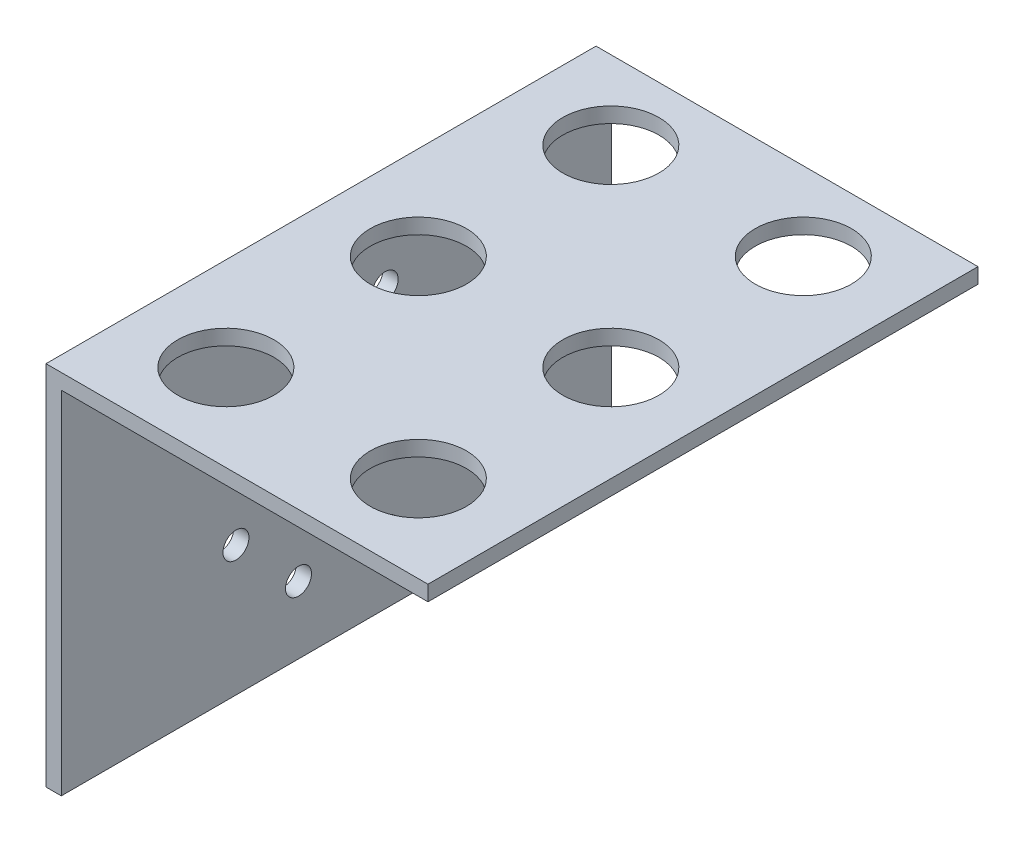
ISO-10303-21;
HEADER;
FILE_DESCRIPTION(('STEP AP214'),'2;1');
FILE_NAME('part.step','',(''),(''),'','','');
FILE_SCHEMA(('AUTOMOTIVE_DESIGN { 1 0 10303 214 1 1 1 1 }'));
ENDSEC;
DATA;
#1=APPLICATION_CONTEXT('core data for automotive mechanical design processes');
#2=APPLICATION_PROTOCOL_DEFINITION('international standard','automotive_design',2000,#1);
#3=PRODUCT_CONTEXT('',#1,'mechanical');
#4=PRODUCT('Part','Part','',(#3));
#5=PRODUCT_RELATED_PRODUCT_CATEGORY('part','',(#4));
#6=PRODUCT_DEFINITION_FORMATION('','',#4);
#7=PRODUCT_DEFINITION_CONTEXT('part definition',#1,'design');
#8=PRODUCT_DEFINITION('design','',#6,#7);
#9=PRODUCT_DEFINITION_SHAPE('','',#8);
#10=(LENGTH_UNIT() NAMED_UNIT(*) SI_UNIT(.MILLI.,.METRE.));
#11=(NAMED_UNIT(*) PLANE_ANGLE_UNIT() SI_UNIT($,.RADIAN.));
#12=(NAMED_UNIT(*) SI_UNIT($,.STERADIAN.) SOLID_ANGLE_UNIT());
#13=UNCERTAINTY_MEASURE_WITH_UNIT(LENGTH_MEASURE(1.E-05),#10,'distance_accuracy_value','');
#14=(GEOMETRIC_REPRESENTATION_CONTEXT(3) GLOBAL_UNCERTAINTY_ASSIGNED_CONTEXT((#13)) GLOBAL_UNIT_ASSIGNED_CONTEXT((#10,
#11,#12)) REPRESENTATION_CONTEXT('',''));
#15=CARTESIAN_POINT('',(0.,0.,0.));
#16=DIRECTION('',(0.,0.,1.));
#17=DIRECTION('',(1.,0.,0.));
#18=AXIS2_PLACEMENT_3D('',#15,#16,#17);
#19=CARTESIAN_POINT('',(-25.6516535121618,-10.7187266461533,57.15));
#20=DIRECTION('',(1.,0.,0.));
#21=DIRECTION('',(0.,0.,-1.));
#22=AXIS2_PLACEMENT_3D('',#19,#20,#21);
#23=PLANE('',#22);
#24=CARTESIAN_POINT('',(-25.6516535121618,-3.71872664615332,32.5));
#25=DIRECTION('',(1.,0.,0.));
#26=DIRECTION('',(0.,0.,-1.));
#27=AXIS2_PLACEMENT_3D('',#24,#25,#26);
#28=CIRCLE('',#27,1.35);
#29=CARTESIAN_POINT('',(-25.6516535121618,-3.71872664615332,31.15));
#30=VERTEX_POINT('',#29);
#31=EDGE_CURVE('E185',#30,#30,#28,.T.);
#32=ORIENTED_EDGE('',*,*,#31,.T.);
#33=EDGE_LOOP('',(#32));
#34=FACE_BOUND('',#33,.T.);
#35=CARTESIAN_POINT('',(-25.6516535121618,-3.71872664615332,23.5));
#36=DIRECTION('',(1.,0.,0.));
#37=DIRECTION('',(0.,0.,-1.));
#38=AXIS2_PLACEMENT_3D('',#35,#36,#37);
#39=CIRCLE('',#38,1.35);
#40=CARTESIAN_POINT('',(-25.6516535121618,-3.71872664615332,22.15));
#41=VERTEX_POINT('',#40);
#42=EDGE_CURVE('E179',#41,#41,#39,.T.);
#43=ORIENTED_EDGE('',*,*,#42,.T.);
#44=EDGE_LOOP('',(#43));
#45=FACE_BOUND('',#44,.T.);
#46=CARTESIAN_POINT('',(-25.6516535121618,2.78127335384669,16.9999999999998));
#47=DIRECTION('',(1.,0.,0.));
#48=DIRECTION('',(0.,0.,-1.));
#49=AXIS2_PLACEMENT_3D('',#46,#47,#48);
#50=CIRCLE('',#49,1.35);
#51=CARTESIAN_POINT('',(-25.6516535121618,2.78127335384669,15.6499999999998));
#52=VERTEX_POINT('',#51);
#53=EDGE_CURVE('E173',#52,#52,#50,.T.);
#54=ORIENTED_EDGE('',*,*,#53,.T.);
#55=EDGE_LOOP('',(#54));
#56=FACE_BOUND('',#55,.T.);
#57=CARTESIAN_POINT('',(-25.6516535121618,11.7812733538467,16.9999999999998));
#58=DIRECTION('',(1.,0.,0.));
#59=DIRECTION('',(0.,0.,-1.));
#60=AXIS2_PLACEMENT_3D('',#57,#58,#59);
#61=CIRCLE('',#60,1.35);
#62=CARTESIAN_POINT('',(-25.6516535121618,11.7812733538467,15.6499999999998));
#63=VERTEX_POINT('',#62);
#64=EDGE_CURVE('E167',#63,#63,#61,.T.);
#65=ORIENTED_EDGE('',*,*,#64,.T.);
#66=EDGE_LOOP('',(#65));
#67=FACE_BOUND('',#66,.T.);
#68=CARTESIAN_POINT('',(-25.6516535121618,18.2812733538467,23.5));
#69=DIRECTION('',(1.,0.,0.));
#70=DIRECTION('',(0.,0.,-1.));
#71=AXIS2_PLACEMENT_3D('',#68,#69,#70);
#72=CIRCLE('',#71,1.35);
#73=CARTESIAN_POINT('',(-25.6516535121618,18.2812733538467,22.15));
#74=VERTEX_POINT('',#73);
#75=EDGE_CURVE('E161',#74,#74,#72,.T.);
#76=ORIENTED_EDGE('',*,*,#75,.T.);
#77=EDGE_LOOP('',(#76));
#78=FACE_BOUND('',#77,.T.);
#79=CARTESIAN_POINT('',(-25.6516535121618,18.2812733538467,32.5));
#80=DIRECTION('',(1.,0.,0.));
#81=DIRECTION('',(0.,0.,-1.));
#82=AXIS2_PLACEMENT_3D('',#79,#80,#81);
#83=CIRCLE('',#82,1.35);
#84=CARTESIAN_POINT('',(-25.6516535121618,18.2812733538467,31.15));
#85=VERTEX_POINT('',#84);
#86=EDGE_CURVE('E155',#85,#85,#83,.T.);
#87=ORIENTED_EDGE('',*,*,#86,.T.);
#88=EDGE_LOOP('',(#87));
#89=FACE_BOUND('',#88,.T.);
#90=CARTESIAN_POINT('',(-25.6516535121618,11.7812733538467,38.9999999999998));
#91=DIRECTION('',(1.,0.,0.));
#92=DIRECTION('',(0.,0.,-1.));
#93=AXIS2_PLACEMENT_3D('',#90,#91,#92);
#94=CIRCLE('',#93,1.35);
#95=CARTESIAN_POINT('',(-25.6516535121618,11.7812733538467,37.6499999999998));
#96=VERTEX_POINT('',#95);
#97=EDGE_CURVE('E149',#96,#96,#94,.T.);
#98=ORIENTED_EDGE('',*,*,#97,.T.);
#99=EDGE_LOOP('',(#98));
#100=FACE_BOUND('',#99,.T.);
#101=CARTESIAN_POINT('',(-25.6516535121618,2.78127335384667,38.9999999999998));
#102=DIRECTION('',(1.,0.,0.));
#103=DIRECTION('',(0.,0.,-1.));
#104=AXIS2_PLACEMENT_3D('',#101,#102,#103);
#105=CIRCLE('',#104,1.35);
#106=CARTESIAN_POINT('',(-25.6516535121618,2.78127335384667,37.6499999999998));
#107=VERTEX_POINT('',#106);
#108=EDGE_CURVE('E120',#107,#107,#105,.T.);
#109=ORIENTED_EDGE('',*,*,#108,.T.);
#110=EDGE_LOOP('',(#109));
#111=FACE_BOUND('',#110,.T.);
#112=DIRECTION('',(0.,-1.,0.));
#113=VECTOR('',#112,1.);
#114=CARTESIAN_POINT('',(-25.6516535121618,-10.7187266461533,0.));
#115=LINE('',#114,#113);
#116=CARTESIAN_POINT('',(-25.6516535121618,27.3812733538467,0.));
#117=VERTEX_POINT('',#116);
#118=CARTESIAN_POINT('',(-25.6516535121618,-10.7187266461533,0.));
#119=VERTEX_POINT('',#118);
#120=EDGE_CURVE('E116',#117,#119,#115,.T.);
#121=ORIENTED_EDGE('',*,*,#120,.T.);
#122=DIRECTION('',(0.,0.,-1.));
#123=VECTOR('',#122,1.);
#124=CARTESIAN_POINT('',(-25.6516535121618,-10.7187266461533,57.15));
#125=LINE('',#124,#123);
#126=CARTESIAN_POINT('',(-25.6516535121618,-10.7187266461533,57.15));
#127=VERTEX_POINT('',#126);
#128=EDGE_CURVE('E11',#127,#119,#125,.T.);
#129=ORIENTED_EDGE('',*,*,#128,.F.);
#130=DIRECTION('',(0.,-1.,0.));
#131=VECTOR('',#130,1.);
#132=CARTESIAN_POINT('',(-25.6516535121618,-10.7187266461533,57.15));
#133=LINE('',#132,#131);
#134=CARTESIAN_POINT('',(-25.6516535121618,27.3812733538467,57.15));
#135=VERTEX_POINT('',#134);
#136=EDGE_CURVE('E128',#135,#127,#133,.T.);
#137=ORIENTED_EDGE('',*,*,#136,.F.);
#138=DIRECTION('',(0.,0.,-1.));
#139=VECTOR('',#138,1.);
#140=CARTESIAN_POINT('',(-25.6516535121618,27.3812733538467,57.15));
#141=LINE('',#140,#139);
#142=EDGE_CURVE('E112',#135,#117,#141,.T.);
#143=ORIENTED_EDGE('',*,*,#142,.T.);
#144=EDGE_LOOP('',(#121,#129,#137,#143));
#145=FACE_BOUND('',#144,.T.);
#146=ADVANCED_FACE('F31',(#34,#45,#56,#67,#78,#89,#100,#111,#145),#23,.F.);
#147=CARTESIAN_POINT('',(-25.6516535121618,-10.7187266461533,57.15));
#148=DIRECTION('',(0.,1.,0.));
#149=DIRECTION('',(0.,0.,1.));
#150=AXIS2_PLACEMENT_3D('',#147,#148,#149);
#151=PLANE('',#150);
#152=DIRECTION('',(1.,0.,0.));
#153=VECTOR('',#152,1.);
#154=CARTESIAN_POINT('',(-25.6516535121618,-10.7187266461533,0.));
#155=LINE('',#154,#153);
#156=CARTESIAN_POINT('',(-24.0641535121618,-10.7187266461533,0.));
#157=VERTEX_POINT('',#156);
#158=EDGE_CURVE('E119',#119,#157,#155,.T.);
#159=ORIENTED_EDGE('',*,*,#158,.T.);
#160=DIRECTION('',(0.,0.,-1.));
#161=VECTOR('',#160,1.);
#162=CARTESIAN_POINT('',(-24.0641535121618,-10.7187266461533,57.15));
#163=LINE('',#162,#161);
#164=CARTESIAN_POINT('',(-24.0641535121618,-10.7187266461533,57.15));
#165=VERTEX_POINT('',#164);
#166=EDGE_CURVE('E39',#165,#157,#163,.T.);
#167=ORIENTED_EDGE('',*,*,#166,.F.);
#168=DIRECTION('',(1.,0.,0.));
#169=VECTOR('',#168,1.);
#170=CARTESIAN_POINT('',(-25.6516535121618,-10.7187266461533,57.15));
#171=LINE('',#170,#169);
#172=EDGE_CURVE('E82',#127,#165,#171,.T.);
#173=ORIENTED_EDGE('',*,*,#172,.F.);
#174=ORIENTED_EDGE('',*,*,#128,.T.);
#175=EDGE_LOOP('',(#159,#167,#173,#174));
#176=FACE_BOUND('',#175,.T.);
#177=ADVANCED_FACE('F267',(#176),#151,.F.);
#178=CARTESIAN_POINT('',(-24.0641535121618,-10.7187266461533,57.15));
#179=DIRECTION('',(-1.,0.,0.));
#180=DIRECTION('',(0.,0.,1.));
#181=AXIS2_PLACEMENT_3D('',#178,#179,#180);
#182=PLANE('',#181);
#183=CARTESIAN_POINT('',(-24.0641535121618,-3.71872664615332,32.5));
#184=DIRECTION('',(1.,0.,0.));
#185=DIRECTION('',(0.,0.,-1.));
#186=AXIS2_PLACEMENT_3D('',#183,#184,#185);
#187=CIRCLE('',#186,1.35);
#188=CARTESIAN_POINT('',(-24.0641535121618,-3.71872664615332,31.15));
#189=VERTEX_POINT('',#188);
#190=EDGE_CURVE('E182',#189,#189,#187,.T.);
#191=ORIENTED_EDGE('',*,*,#190,.F.);
#192=EDGE_LOOP('',(#191));
#193=FACE_BOUND('',#192,.T.);
#194=CARTESIAN_POINT('',(-24.0641535121618,-3.71872664615332,23.5));
#195=DIRECTION('',(1.,0.,0.));
#196=DIRECTION('',(0.,0.,-1.));
#197=AXIS2_PLACEMENT_3D('',#194,#195,#196);
#198=CIRCLE('',#197,1.35);
#199=CARTESIAN_POINT('',(-24.0641535121618,-3.71872664615332,22.15));
#200=VERTEX_POINT('',#199);
#201=EDGE_CURVE('E176',#200,#200,#198,.T.);
#202=ORIENTED_EDGE('',*,*,#201,.F.);
#203=EDGE_LOOP('',(#202));
#204=FACE_BOUND('',#203,.T.);
#205=CARTESIAN_POINT('',(-24.0641535121618,2.78127335384669,16.9999999999998));
#206=DIRECTION('',(1.,0.,0.));
#207=DIRECTION('',(0.,0.,-1.));
#208=AXIS2_PLACEMENT_3D('',#205,#206,#207);
#209=CIRCLE('',#208,1.35);
#210=CARTESIAN_POINT('',(-24.0641535121618,2.78127335384669,15.6499999999998));
#211=VERTEX_POINT('',#210);
#212=EDGE_CURVE('E170',#211,#211,#209,.T.);
#213=ORIENTED_EDGE('',*,*,#212,.F.);
#214=EDGE_LOOP('',(#213));
#215=FACE_BOUND('',#214,.T.);
#216=CARTESIAN_POINT('',(-24.0641535121618,11.7812733538467,16.9999999999998));
#217=DIRECTION('',(1.,0.,0.));
#218=DIRECTION('',(0.,0.,-1.));
#219=AXIS2_PLACEMENT_3D('',#216,#217,#218);
#220=CIRCLE('',#219,1.35);
#221=CARTESIAN_POINT('',(-24.0641535121618,11.7812733538467,15.6499999999998));
#222=VERTEX_POINT('',#221);
#223=EDGE_CURVE('E164',#222,#222,#220,.T.);
#224=ORIENTED_EDGE('',*,*,#223,.F.);
#225=EDGE_LOOP('',(#224));
#226=FACE_BOUND('',#225,.T.);
#227=CARTESIAN_POINT('',(-24.0641535121618,18.2812733538467,23.5));
#228=DIRECTION('',(1.,0.,0.));
#229=DIRECTION('',(0.,0.,-1.));
#230=AXIS2_PLACEMENT_3D('',#227,#228,#229);
#231=CIRCLE('',#230,1.35);
#232=CARTESIAN_POINT('',(-24.0641535121618,18.2812733538467,22.15));
#233=VERTEX_POINT('',#232);
#234=EDGE_CURVE('E158',#233,#233,#231,.T.);
#235=ORIENTED_EDGE('',*,*,#234,.F.);
#236=EDGE_LOOP('',(#235));
#237=FACE_BOUND('',#236,.T.);
#238=CARTESIAN_POINT('',(-24.0641535121618,18.2812733538467,32.5));
#239=DIRECTION('',(1.,0.,0.));
#240=DIRECTION('',(0.,0.,-1.));
#241=AXIS2_PLACEMENT_3D('',#238,#239,#240);
#242=CIRCLE('',#241,1.35);
#243=CARTESIAN_POINT('',(-24.0641535121618,18.2812733538467,31.15));
#244=VERTEX_POINT('',#243);
#245=EDGE_CURVE('E152',#244,#244,#242,.T.);
#246=ORIENTED_EDGE('',*,*,#245,.F.);
#247=EDGE_LOOP('',(#246));
#248=FACE_BOUND('',#247,.T.);
#249=CARTESIAN_POINT('',(-24.0641535121618,11.7812733538467,38.9999999999998));
#250=DIRECTION('',(1.,0.,0.));
#251=DIRECTION('',(0.,0.,-1.));
#252=AXIS2_PLACEMENT_3D('',#249,#250,#251);
#253=CIRCLE('',#252,1.35);
#254=CARTESIAN_POINT('',(-24.0641535121618,11.7812733538467,37.6499999999998));
#255=VERTEX_POINT('',#254);
#256=EDGE_CURVE('E146',#255,#255,#253,.T.);
#257=ORIENTED_EDGE('',*,*,#256,.F.);
#258=EDGE_LOOP('',(#257));
#259=FACE_BOUND('',#258,.T.);
#260=CARTESIAN_POINT('',(-24.0641535121618,2.78127335384667,38.9999999999998));
#261=DIRECTION('',(1.,0.,0.));
#262=DIRECTION('',(0.,0.,-1.));
#263=AXIS2_PLACEMENT_3D('',#260,#261,#262);
#264=CIRCLE('',#263,1.35);
#265=CARTESIAN_POINT('',(-24.0641535121618,2.78127335384667,37.6499999999998));
#266=VERTEX_POINT('',#265);
#267=EDGE_CURVE('E143',#266,#266,#264,.T.);
#268=ORIENTED_EDGE('',*,*,#267,.F.);
#269=EDGE_LOOP('',(#268));
#270=FACE_BOUND('',#269,.T.);
#271=DIRECTION('',(0.,1.,0.));
#272=VECTOR('',#271,1.);
#273=CARTESIAN_POINT('',(-24.0641535121618,-10.7187266461533,0.));
#274=LINE('',#273,#272);
#275=CARTESIAN_POINT('',(-24.0641535121618,25.7937733538467,0.));
#276=VERTEX_POINT('',#275);
#277=EDGE_CURVE('E122',#157,#276,#274,.T.);
#278=ORIENTED_EDGE('',*,*,#277,.T.);
#279=DIRECTION('',(0.,0.,-1.));
#280=VECTOR('',#279,1.);
#281=CARTESIAN_POINT('',(-24.0641535121618,25.7937733538467,57.15));
#282=LINE('',#281,#280);
#283=CARTESIAN_POINT('',(-24.0641535121618,25.7937733538467,57.15));
#284=VERTEX_POINT('',#283);
#285=EDGE_CURVE('E107',#284,#276,#282,.T.);
#286=ORIENTED_EDGE('',*,*,#285,.F.);
#287=DIRECTION('',(0.,1.,0.));
#288=VECTOR('',#287,1.);
#289=CARTESIAN_POINT('',(-24.0641535121618,-10.7187266461533,57.15));
#290=LINE('',#289,#288);
#291=EDGE_CURVE('E96',#165,#284,#290,.T.);
#292=ORIENTED_EDGE('',*,*,#291,.F.);
#293=ORIENTED_EDGE('',*,*,#166,.T.);
#294=EDGE_LOOP('',(#278,#286,#292,#293));
#295=FACE_BOUND('',#294,.T.);
#296=ADVANCED_FACE('F134',(#193,#204,#215,#226,#237,#248,#259,#270,#295),#182,.F.);
#297=CARTESIAN_POINT('',(-24.0641535121618,25.7937733538467,57.15));
#298=DIRECTION('',(0.,1.,0.));
#299=DIRECTION('',(0.,0.,1.));
#300=AXIS2_PLACEMENT_3D('',#297,#298,#299);
#301=PLANE('',#300);
#302=CARTESIAN_POINT('',(-15.9641535121618,25.7937733538467,8.15));
#303=DIRECTION('',(0.,-1.,0.));
#304=DIRECTION('',(0.,0.,-1.));
#305=AXIS2_PLACEMENT_3D('',#302,#303,#304);
#306=CIRCLE('',#305,5.);
#307=CARTESIAN_POINT('',(-15.9641535121618,25.7937733538467,3.15));
#308=VERTEX_POINT('',#307);
#309=EDGE_CURVE('E221',#308,#308,#306,.T.);
#310=ORIENTED_EDGE('',*,*,#309,.F.);
#311=EDGE_LOOP('',(#310));
#312=FACE_BOUND('',#311,.T.);
#313=CARTESIAN_POINT('',(-15.9641535121618,25.7937733538467,28.15));
#314=DIRECTION('',(0.,-1.,0.));
#315=DIRECTION('',(0.,0.,-1.));
#316=AXIS2_PLACEMENT_3D('',#313,#314,#315);
#317=CIRCLE('',#316,5.);
#318=CARTESIAN_POINT('',(-15.9641535121618,25.7937733538467,23.15));
#319=VERTEX_POINT('',#318);
#320=EDGE_CURVE('E215',#319,#319,#317,.T.);
#321=ORIENTED_EDGE('',*,*,#320,.F.);
#322=EDGE_LOOP('',(#321));
#323=FACE_BOUND('',#322,.T.);
#324=CARTESIAN_POINT('',(-15.9641535121618,25.7937733538467,48.15));
#325=DIRECTION('',(0.,-1.,0.));
#326=DIRECTION('',(0.,0.,-1.));
#327=AXIS2_PLACEMENT_3D('',#324,#325,#326);
#328=CIRCLE('',#327,5.);
#329=CARTESIAN_POINT('',(-15.9641535121618,25.7937733538467,43.15));
#330=VERTEX_POINT('',#329);
#331=EDGE_CURVE('E209',#330,#330,#328,.T.);
#332=ORIENTED_EDGE('',*,*,#331,.F.);
#333=EDGE_LOOP('',(#332));
#334=FACE_BOUND('',#333,.T.);
#335=CARTESIAN_POINT('',(4.03584648783822,25.7937733538467,8.15));
#336=DIRECTION('',(0.,-1.,0.));
#337=DIRECTION('',(0.,0.,-1.));
#338=AXIS2_PLACEMENT_3D('',#335,#336,#337);
#339=CIRCLE('',#338,5.);
#340=CARTESIAN_POINT('',(4.03584648783822,25.7937733538467,3.15));
#341=VERTEX_POINT('',#340);
#342=EDGE_CURVE('E203',#341,#341,#339,.T.);
#343=ORIENTED_EDGE('',*,*,#342,.F.);
#344=EDGE_LOOP('',(#343));
#345=FACE_BOUND('',#344,.T.);
#346=CARTESIAN_POINT('',(4.03584648783822,25.7937733538467,28.15));
#347=DIRECTION('',(0.,-1.,0.));
#348=DIRECTION('',(0.,0.,-1.));
#349=AXIS2_PLACEMENT_3D('',#346,#347,#348);
#350=CIRCLE('',#349,5.);
#351=CARTESIAN_POINT('',(4.03584648783822,25.7937733538467,23.15));
#352=VERTEX_POINT('',#351);
#353=EDGE_CURVE('E197',#352,#352,#350,.T.);
#354=ORIENTED_EDGE('',*,*,#353,.F.);
#355=EDGE_LOOP('',(#354));
#356=FACE_BOUND('',#355,.T.);
#357=CARTESIAN_POINT('',(4.03584648783822,25.7937733538467,48.15));
#358=DIRECTION('',(0.,-1.,0.));
#359=DIRECTION('',(0.,0.,-1.));
#360=AXIS2_PLACEMENT_3D('',#357,#358,#359);
#361=CIRCLE('',#360,5.);
#362=CARTESIAN_POINT('',(4.03584648783822,25.7937733538467,43.15));
#363=VERTEX_POINT('',#362);
#364=EDGE_CURVE('E191',#363,#363,#361,.T.);
#365=ORIENTED_EDGE('',*,*,#364,.F.);
#366=EDGE_LOOP('',(#365));
#367=FACE_BOUND('',#366,.T.);
#368=DIRECTION('',(1.,0.,0.));
#369=VECTOR('',#368,1.);
#370=CARTESIAN_POINT('',(-24.0641535121618,25.7937733538467,0.));
#371=LINE('',#370,#369);
#372=CARTESIAN_POINT('',(14.0358464878382,25.7937733538467,0.));
#373=VERTEX_POINT('',#372);
#374=EDGE_CURVE('E105',#276,#373,#371,.T.);
#375=ORIENTED_EDGE('',*,*,#374,.T.);
#376=DIRECTION('',(0.,0.,-1.));
#377=VECTOR('',#376,1.);
#378=CARTESIAN_POINT('',(14.0358464878382,25.7937733538467,57.15));
#379=LINE('',#378,#377);
#380=CARTESIAN_POINT('',(14.0358464878382,25.7937733538467,57.15));
#381=VERTEX_POINT('',#380);
#382=EDGE_CURVE('E102',#381,#373,#379,.T.);
#383=ORIENTED_EDGE('',*,*,#382,.F.);
#384=DIRECTION('',(1.,0.,0.));
#385=VECTOR('',#384,1.);
#386=CARTESIAN_POINT('',(-24.0641535121618,25.7937733538467,57.15));
#387=LINE('',#386,#385);
#388=EDGE_CURVE('E89',#284,#381,#387,.T.);
#389=ORIENTED_EDGE('',*,*,#388,.F.);
#390=ORIENTED_EDGE('',*,*,#285,.T.);
#391=EDGE_LOOP('',(#375,#383,#389,#390));
#392=FACE_BOUND('',#391,.T.);
#393=ADVANCED_FACE('F103',(#312,#323,#334,#345,#356,#367,#392),#301,.F.);
#394=CARTESIAN_POINT('',(14.0358464878382,27.3812733538467,57.15));
#395=DIRECTION('',(-1.,0.,0.));
#396=DIRECTION('',(0.,-1.,0.));
#397=AXIS2_PLACEMENT_3D('',#394,#395,#396);
#398=PLANE('',#397);
#399=DIRECTION('',(0.,1.,0.));
#400=VECTOR('',#399,1.);
#401=CARTESIAN_POINT('',(14.0358464878382,27.3812733538467,0.));
#402=LINE('',#401,#400);
#403=CARTESIAN_POINT('',(14.0358464878382,27.3812733538467,0.));
#404=VERTEX_POINT('',#403);
#405=EDGE_CURVE('E125',#373,#404,#402,.T.);
#406=ORIENTED_EDGE('',*,*,#405,.T.);
#407=DIRECTION('',(0.,0.,-1.));
#408=VECTOR('',#407,1.);
#409=CARTESIAN_POINT('',(14.0358464878382,27.3812733538467,57.15));
#410=LINE('',#409,#408);
#411=CARTESIAN_POINT('',(14.0358464878382,27.3812733538467,57.15));
#412=VERTEX_POINT('',#411);
#413=EDGE_CURVE('E108',#412,#404,#410,.T.);
#414=ORIENTED_EDGE('',*,*,#413,.F.);
#415=DIRECTION('',(0.,1.,0.));
#416=VECTOR('',#415,1.);
#417=CARTESIAN_POINT('',(14.0358464878382,27.3812733538467,57.15));
#418=LINE('',#417,#416);
#419=EDGE_CURVE('E93',#381,#412,#418,.T.);
#420=ORIENTED_EDGE('',*,*,#419,.F.);
#421=ORIENTED_EDGE('',*,*,#382,.T.);
#422=EDGE_LOOP('',(#406,#414,#420,#421));
#423=FACE_BOUND('',#422,.T.);
#424=ADVANCED_FACE('F110',(#423),#398,.F.);
#425=CARTESIAN_POINT('',(-25.6516535121618,27.3812733538467,57.15));
#426=DIRECTION('',(0.,-1.,0.));
#427=DIRECTION('',(0.,0.,-1.));
#428=AXIS2_PLACEMENT_3D('',#425,#426,#427);
#429=PLANE('',#428);
#430=CARTESIAN_POINT('',(-15.9641535121618,27.3812733538467,8.15));
#431=DIRECTION('',(0.,-1.,0.));
#432=DIRECTION('',(0.,0.,-1.));
#433=AXIS2_PLACEMENT_3D('',#430,#431,#432);
#434=CIRCLE('',#433,5.);
#435=CARTESIAN_POINT('',(-15.9641535121618,27.3812733538467,3.15));
#436=VERTEX_POINT('',#435);
#437=EDGE_CURVE('E218',#436,#436,#434,.T.);
#438=ORIENTED_EDGE('',*,*,#437,.T.);
#439=EDGE_LOOP('',(#438));
#440=FACE_BOUND('',#439,.T.);
#441=CARTESIAN_POINT('',(-15.9641535121618,27.3812733538467,28.15));
#442=DIRECTION('',(0.,-1.,0.));
#443=DIRECTION('',(0.,0.,-1.));
#444=AXIS2_PLACEMENT_3D('',#441,#442,#443);
#445=CIRCLE('',#444,5.);
#446=CARTESIAN_POINT('',(-15.9641535121618,27.3812733538467,23.15));
#447=VERTEX_POINT('',#446);
#448=EDGE_CURVE('E212',#447,#447,#445,.T.);
#449=ORIENTED_EDGE('',*,*,#448,.T.);
#450=EDGE_LOOP('',(#449));
#451=FACE_BOUND('',#450,.T.);
#452=CARTESIAN_POINT('',(-15.9641535121618,27.3812733538467,48.15));
#453=DIRECTION('',(0.,-1.,0.));
#454=DIRECTION('',(0.,0.,-1.));
#455=AXIS2_PLACEMENT_3D('',#452,#453,#454);
#456=CIRCLE('',#455,5.);
#457=CARTESIAN_POINT('',(-15.9641535121618,27.3812733538467,43.15));
#458=VERTEX_POINT('',#457);
#459=EDGE_CURVE('E206',#458,#458,#456,.T.);
#460=ORIENTED_EDGE('',*,*,#459,.T.);
#461=EDGE_LOOP('',(#460));
#462=FACE_BOUND('',#461,.T.);
#463=CARTESIAN_POINT('',(4.03584648783822,27.3812733538467,8.15));
#464=DIRECTION('',(0.,-1.,0.));
#465=DIRECTION('',(0.,0.,-1.));
#466=AXIS2_PLACEMENT_3D('',#463,#464,#465);
#467=CIRCLE('',#466,5.);
#468=CARTESIAN_POINT('',(4.03584648783822,27.3812733538467,3.15));
#469=VERTEX_POINT('',#468);
#470=EDGE_CURVE('E200',#469,#469,#467,.T.);
#471=ORIENTED_EDGE('',*,*,#470,.T.);
#472=EDGE_LOOP('',(#471));
#473=FACE_BOUND('',#472,.T.);
#474=CARTESIAN_POINT('',(4.03584648783822,27.3812733538467,28.15));
#475=DIRECTION('',(0.,-1.,0.));
#476=DIRECTION('',(0.,0.,-1.));
#477=AXIS2_PLACEMENT_3D('',#474,#475,#476);
#478=CIRCLE('',#477,5.);
#479=CARTESIAN_POINT('',(4.03584648783822,27.3812733538467,23.15));
#480=VERTEX_POINT('',#479);
#481=EDGE_CURVE('E194',#480,#480,#478,.T.);
#482=ORIENTED_EDGE('',*,*,#481,.T.);
#483=EDGE_LOOP('',(#482));
#484=FACE_BOUND('',#483,.T.);
#485=CARTESIAN_POINT('',(4.03584648783822,27.3812733538467,48.15));
#486=DIRECTION('',(0.,-1.,0.));
#487=DIRECTION('',(0.,0.,-1.));
#488=AXIS2_PLACEMENT_3D('',#485,#486,#487);
#489=CIRCLE('',#488,5.);
#490=CARTESIAN_POINT('',(4.03584648783822,27.3812733538467,43.15));
#491=VERTEX_POINT('',#490);
#492=EDGE_CURVE('E188',#491,#491,#489,.T.);
#493=ORIENTED_EDGE('',*,*,#492,.T.);
#494=EDGE_LOOP('',(#493));
#495=FACE_BOUND('',#494,.T.);
#496=DIRECTION('',(-1.,0.,0.));
#497=VECTOR('',#496,1.);
#498=CARTESIAN_POINT('',(-25.6516535121618,27.3812733538467,0.));
#499=LINE('',#498,#497);
#500=EDGE_CURVE('E70',#404,#117,#499,.T.);
#501=ORIENTED_EDGE('',*,*,#500,.T.);
#502=ORIENTED_EDGE('',*,*,#142,.F.);
#503=DIRECTION('',(-1.,0.,0.));
#504=VECTOR('',#503,1.);
#505=CARTESIAN_POINT('',(-24.0641535121618,27.3812733538467,57.15));
#506=LINE('',#505,#504);
#507=EDGE_CURVE('E47',#412,#135,#506,.T.);
#508=ORIENTED_EDGE('',*,*,#507,.F.);
#509=ORIENTED_EDGE('',*,*,#413,.T.);
#510=EDGE_LOOP('',(#501,#502,#508,#509));
#511=FACE_BOUND('',#510,.T.);
#512=ADVANCED_FACE('F136',(#440,#451,#462,#473,#484,#495,#511),#429,.F.);
#513=CARTESIAN_POINT('',(-25.6516535121618,27.3812733538467,57.15));
#514=DIRECTION('',(0.,0.,-1.));
#515=DIRECTION('',(-1.,0.,0.));
#516=AXIS2_PLACEMENT_3D('',#513,#514,#515);
#517=PLANE('',#516);
#518=ORIENTED_EDGE('',*,*,#136,.T.);
#519=ORIENTED_EDGE('',*,*,#172,.T.);
#520=ORIENTED_EDGE('',*,*,#291,.T.);
#521=ORIENTED_EDGE('',*,*,#388,.T.);
#522=ORIENTED_EDGE('',*,*,#419,.T.);
#523=ORIENTED_EDGE('',*,*,#507,.T.);
#524=EDGE_LOOP('',(#518,#519,#520,#521,#522,#523));
#525=FACE_BOUND('',#524,.T.);
#526=ADVANCED_FACE('F91',(#525),#517,.F.);
#527=CARTESIAN_POINT('',(-25.6516535121618,27.3812733538467,0.));
#528=DIRECTION('',(0.,0.,-1.));
#529=DIRECTION('',(-1.,0.,0.));
#530=AXIS2_PLACEMENT_3D('',#527,#528,#529);
#531=PLANE('',#530);
#532=ORIENTED_EDGE('',*,*,#120,.F.);
#533=ORIENTED_EDGE('',*,*,#500,.F.);
#534=ORIENTED_EDGE('',*,*,#405,.F.);
#535=ORIENTED_EDGE('',*,*,#374,.F.);
#536=ORIENTED_EDGE('',*,*,#277,.F.);
#537=ORIENTED_EDGE('',*,*,#158,.F.);
#538=EDGE_LOOP('',(#532,#533,#534,#535,#536,#537));
#539=FACE_BOUND('',#538,.T.);
#540=ADVANCED_FACE('F135',(#539),#531,.T.);
#541=CARTESIAN_POINT('',(-25.6516535121618,2.78127335384667,38.9999999999998));
#542=DIRECTION('',(1.,0.,0.));
#543=DIRECTION('',(0.,0.,-1.));
#544=AXIS2_PLACEMENT_3D('',#541,#542,#543);
#545=CYLINDRICAL_SURFACE('',#544,1.35);
#546=ORIENTED_EDGE('',*,*,#108,.F.);
#547=EDGE_LOOP('',(#546));
#548=FACE_BOUND('',#547,.T.);
#549=ORIENTED_EDGE('',*,*,#267,.T.);
#550=EDGE_LOOP('',(#549));
#551=FACE_BOUND('',#550,.T.);
#552=ADVANCED_FACE('F290',(#548,#551),#545,.F.);
#553=CARTESIAN_POINT('',(-25.6516535121618,11.7812733538467,38.9999999999998));
#554=DIRECTION('',(1.,0.,0.));
#555=DIRECTION('',(0.,0.,-1.));
#556=AXIS2_PLACEMENT_3D('',#553,#554,#555);
#557=CYLINDRICAL_SURFACE('',#556,1.35);
#558=ORIENTED_EDGE('',*,*,#97,.F.);
#559=EDGE_LOOP('',(#558));
#560=FACE_BOUND('',#559,.T.);
#561=ORIENTED_EDGE('',*,*,#256,.T.);
#562=EDGE_LOOP('',(#561));
#563=FACE_BOUND('',#562,.T.);
#564=ADVANCED_FACE('F293',(#560,#563),#557,.F.);
#565=CARTESIAN_POINT('',(-25.6516535121618,18.2812733538467,32.5));
#566=DIRECTION('',(1.,0.,0.));
#567=DIRECTION('',(0.,0.,-1.));
#568=AXIS2_PLACEMENT_3D('',#565,#566,#567);
#569=CYLINDRICAL_SURFACE('',#568,1.35);
#570=ORIENTED_EDGE('',*,*,#86,.F.);
#571=EDGE_LOOP('',(#570));
#572=FACE_BOUND('',#571,.T.);
#573=ORIENTED_EDGE('',*,*,#245,.T.);
#574=EDGE_LOOP('',(#573));
#575=FACE_BOUND('',#574,.T.);
#576=ADVANCED_FACE('F315',(#572,#575),#569,.F.);
#577=CARTESIAN_POINT('',(-25.6516535121618,18.2812733538467,23.5));
#578=DIRECTION('',(1.,0.,0.));
#579=DIRECTION('',(0.,0.,-1.));
#580=AXIS2_PLACEMENT_3D('',#577,#578,#579);
#581=CYLINDRICAL_SURFACE('',#580,1.35);
#582=ORIENTED_EDGE('',*,*,#75,.F.);
#583=EDGE_LOOP('',(#582));
#584=FACE_BOUND('',#583,.T.);
#585=ORIENTED_EDGE('',*,*,#234,.T.);
#586=EDGE_LOOP('',(#585));
#587=FACE_BOUND('',#586,.T.);
#588=ADVANCED_FACE('F319',(#584,#587),#581,.F.);
#589=CARTESIAN_POINT('',(-25.6516535121618,11.7812733538467,16.9999999999998));
#590=DIRECTION('',(1.,0.,0.));
#591=DIRECTION('',(0.,0.,-1.));
#592=AXIS2_PLACEMENT_3D('',#589,#590,#591);
#593=CYLINDRICAL_SURFACE('',#592,1.35);
#594=ORIENTED_EDGE('',*,*,#64,.F.);
#595=EDGE_LOOP('',(#594));
#596=FACE_BOUND('',#595,.T.);
#597=ORIENTED_EDGE('',*,*,#223,.T.);
#598=EDGE_LOOP('',(#597));
#599=FACE_BOUND('',#598,.T.);
#600=ADVANCED_FACE('F323',(#596,#599),#593,.F.);
#601=CARTESIAN_POINT('',(-25.6516535121618,2.78127335384669,16.9999999999998));
#602=DIRECTION('',(1.,0.,0.));
#603=DIRECTION('',(0.,0.,-1.));
#604=AXIS2_PLACEMENT_3D('',#601,#602,#603);
#605=CYLINDRICAL_SURFACE('',#604,1.35);
#606=ORIENTED_EDGE('',*,*,#53,.F.);
#607=EDGE_LOOP('',(#606));
#608=FACE_BOUND('',#607,.T.);
#609=ORIENTED_EDGE('',*,*,#212,.T.);
#610=EDGE_LOOP('',(#609));
#611=FACE_BOUND('',#610,.T.);
#612=ADVANCED_FACE('F327',(#608,#611),#605,.F.);
#613=CARTESIAN_POINT('',(-25.6516535121618,-3.71872664615332,23.5));
#614=DIRECTION('',(1.,0.,0.));
#615=DIRECTION('',(0.,0.,-1.));
#616=AXIS2_PLACEMENT_3D('',#613,#614,#615);
#617=CYLINDRICAL_SURFACE('',#616,1.35);
#618=ORIENTED_EDGE('',*,*,#42,.F.);
#619=EDGE_LOOP('',(#618));
#620=FACE_BOUND('',#619,.T.);
#621=ORIENTED_EDGE('',*,*,#201,.T.);
#622=EDGE_LOOP('',(#621));
#623=FACE_BOUND('',#622,.T.);
#624=ADVANCED_FACE('F262',(#620,#623),#617,.F.);
#625=CARTESIAN_POINT('',(-25.6516535121618,-3.71872664615332,32.5));
#626=DIRECTION('',(1.,0.,0.));
#627=DIRECTION('',(0.,0.,-1.));
#628=AXIS2_PLACEMENT_3D('',#625,#626,#627);
#629=CYLINDRICAL_SURFACE('',#628,1.35);
#630=ORIENTED_EDGE('',*,*,#31,.F.);
#631=EDGE_LOOP('',(#630));
#632=FACE_BOUND('',#631,.T.);
#633=ORIENTED_EDGE('',*,*,#190,.T.);
#634=EDGE_LOOP('',(#633));
#635=FACE_BOUND('',#634,.T.);
#636=ADVANCED_FACE('F252',(#632,#635),#629,.F.);
#637=CARTESIAN_POINT('',(4.03584648783822,27.3812733538467,48.15));
#638=DIRECTION('',(0.,-1.,0.));
#639=DIRECTION('',(0.,0.,-1.));
#640=AXIS2_PLACEMENT_3D('',#637,#638,#639);
#641=CYLINDRICAL_SURFACE('',#640,5.);
#642=ORIENTED_EDGE('',*,*,#492,.F.);
#643=EDGE_LOOP('',(#642));
#644=FACE_BOUND('',#643,.T.);
#645=ORIENTED_EDGE('',*,*,#364,.T.);
#646=EDGE_LOOP('',(#645));
#647=FACE_BOUND('',#646,.T.);
#648=ADVANCED_FACE('F249',(#644,#647),#641,.F.);
#649=CARTESIAN_POINT('',(4.03584648783822,27.3812733538467,28.15));
#650=DIRECTION('',(0.,-1.,0.));
#651=DIRECTION('',(0.,0.,-1.));
#652=AXIS2_PLACEMENT_3D('',#649,#650,#651);
#653=CYLINDRICAL_SURFACE('',#652,5.);
#654=ORIENTED_EDGE('',*,*,#481,.F.);
#655=EDGE_LOOP('',(#654));
#656=FACE_BOUND('',#655,.T.);
#657=ORIENTED_EDGE('',*,*,#353,.T.);
#658=EDGE_LOOP('',(#657));
#659=FACE_BOUND('',#658,.T.);
#660=ADVANCED_FACE('F251',(#656,#659),#653,.F.);
#661=CARTESIAN_POINT('',(4.03584648783822,27.3812733538467,8.15));
#662=DIRECTION('',(0.,-1.,0.));
#663=DIRECTION('',(0.,0.,-1.));
#664=AXIS2_PLACEMENT_3D('',#661,#662,#663);
#665=CYLINDRICAL_SURFACE('',#664,5.);
#666=ORIENTED_EDGE('',*,*,#470,.F.);
#667=EDGE_LOOP('',(#666));
#668=FACE_BOUND('',#667,.T.);
#669=ORIENTED_EDGE('',*,*,#342,.T.);
#670=EDGE_LOOP('',(#669));
#671=FACE_BOUND('',#670,.T.);
#672=ADVANCED_FACE('F259',(#668,#671),#665,.F.);
#673=CARTESIAN_POINT('',(-15.9641535121618,27.3812733538467,48.15));
#674=DIRECTION('',(0.,-1.,0.));
#675=DIRECTION('',(0.,0.,-1.));
#676=AXIS2_PLACEMENT_3D('',#673,#674,#675);
#677=CYLINDRICAL_SURFACE('',#676,5.);
#678=ORIENTED_EDGE('',*,*,#459,.F.);
#679=EDGE_LOOP('',(#678));
#680=FACE_BOUND('',#679,.T.);
#681=ORIENTED_EDGE('',*,*,#331,.T.);
#682=EDGE_LOOP('',(#681));
#683=FACE_BOUND('',#682,.T.);
#684=ADVANCED_FACE('F386',(#680,#683),#677,.F.);
#685=CARTESIAN_POINT('',(-15.9641535121618,27.3812733538467,28.15));
#686=DIRECTION('',(0.,-1.,0.));
#687=DIRECTION('',(0.,0.,-1.));
#688=AXIS2_PLACEMENT_3D('',#685,#686,#687);
#689=CYLINDRICAL_SURFACE('',#688,5.);
#690=ORIENTED_EDGE('',*,*,#448,.F.);
#691=EDGE_LOOP('',(#690));
#692=FACE_BOUND('',#691,.T.);
#693=ORIENTED_EDGE('',*,*,#320,.T.);
#694=EDGE_LOOP('',(#693));
#695=FACE_BOUND('',#694,.T.);
#696=ADVANCED_FACE('F232',(#692,#695),#689,.F.);
#697=CARTESIAN_POINT('',(-15.9641535121618,27.3812733538467,8.15));
#698=DIRECTION('',(0.,-1.,0.));
#699=DIRECTION('',(0.,0.,-1.));
#700=AXIS2_PLACEMENT_3D('',#697,#698,#699);
#701=CYLINDRICAL_SURFACE('',#700,5.);
#702=ORIENTED_EDGE('',*,*,#437,.F.);
#703=EDGE_LOOP('',(#702));
#704=FACE_BOUND('',#703,.T.);
#705=ORIENTED_EDGE('',*,*,#309,.T.);
#706=EDGE_LOOP('',(#705));
#707=FACE_BOUND('',#706,.T.);
#708=ADVANCED_FACE('F229',(#704,#707),#701,.F.);
#709=CLOSED_SHELL('',(#146,#177,#296,#393,#424,#512,#526,#540,#552,#564,#576,#588,#600,#612,
#624,#636,#648,#660,#672,#684,#696,#708));
#710=MANIFOLD_SOLID_BREP('B2',#709);
#711=ADVANCED_BREP_SHAPE_REPRESENTATION('',(#18,#710),#14);
#712=SHAPE_DEFINITION_REPRESENTATION(#9,#711);
ENDSEC;
END-ISO-10303-21;
